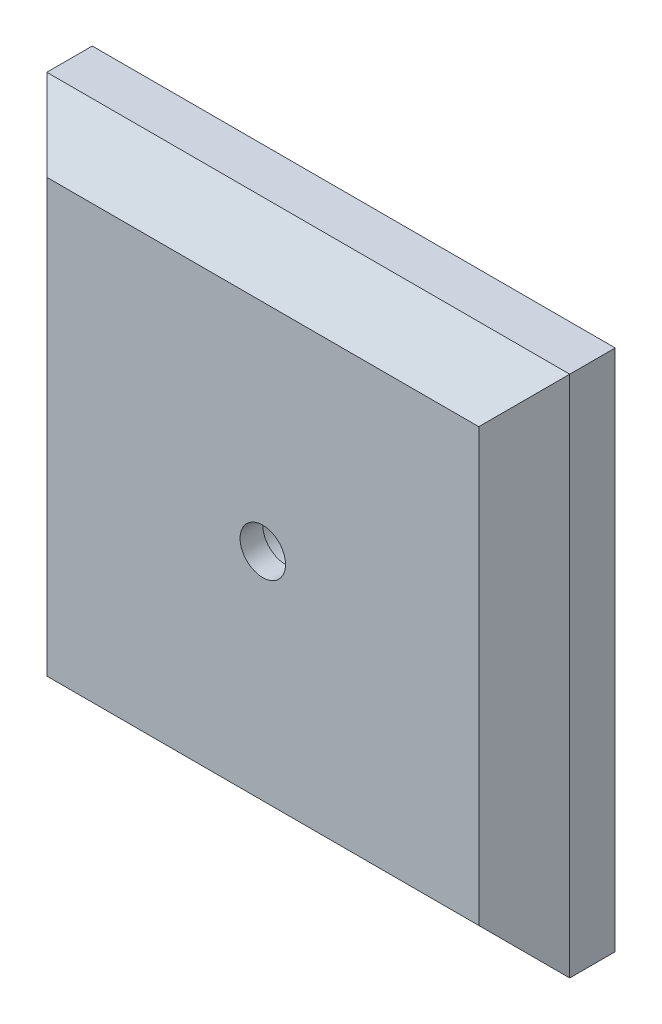
ISO-10303-21;
HEADER;
FILE_DESCRIPTION(('STEP AP214'),'2;1');
FILE_NAME('part.step','',(''),(''),'','','');
FILE_SCHEMA(('AUTOMOTIVE_DESIGN { 1 0 10303 214 1 1 1 1 }'));
ENDSEC;
DATA;
#1=APPLICATION_CONTEXT('core data for automotive mechanical design processes');
#2=APPLICATION_PROTOCOL_DEFINITION('international standard','automotive_design',2000,#1);
#3=PRODUCT_CONTEXT('',#1,'mechanical');
#4=PRODUCT('Part','Part','',(#3));
#5=PRODUCT_RELATED_PRODUCT_CATEGORY('part','',(#4));
#6=PRODUCT_DEFINITION_FORMATION('','',#4);
#7=PRODUCT_DEFINITION_CONTEXT('part definition',#1,'design');
#8=PRODUCT_DEFINITION('design','',#6,#7);
#9=PRODUCT_DEFINITION_SHAPE('','',#8);
#10=(LENGTH_UNIT() NAMED_UNIT(*) SI_UNIT(.MILLI.,.METRE.));
#11=(NAMED_UNIT(*) PLANE_ANGLE_UNIT() SI_UNIT($,.RADIAN.));
#12=(NAMED_UNIT(*) SI_UNIT($,.STERADIAN.) SOLID_ANGLE_UNIT());
#13=UNCERTAINTY_MEASURE_WITH_UNIT(LENGTH_MEASURE(1.E-05),#10,'distance_accuracy_value','');
#14=(GEOMETRIC_REPRESENTATION_CONTEXT(3) GLOBAL_UNCERTAINTY_ASSIGNED_CONTEXT((#13)) GLOBAL_UNIT_ASSIGNED_CONTEXT((#10,
#11,#12)) REPRESENTATION_CONTEXT('',''));
#15=CARTESIAN_POINT('',(0.,0.,0.));
#16=DIRECTION('',(0.,0.,1.));
#17=DIRECTION('',(1.,0.,0.));
#18=AXIS2_PLACEMENT_3D('',#15,#16,#17);
#19=CARTESIAN_POINT('',(-36.5125,-36.5125,-12.7));
#20=DIRECTION('',(-1.,0.,0.));
#21=DIRECTION('',(0.,0.,1.));
#22=AXIS2_PLACEMENT_3D('',#19,#20,#21);
#23=PLANE('',#22);
#24=DIRECTION('',(0.,0.,1.));
#25=VECTOR('',#24,1.);
#26=CARTESIAN_POINT('',(-36.5125,-36.5125,-12.7));
#27=LINE('',#26,#25);
#28=CARTESIAN_POINT('',(-36.5125,-36.5125,-12.7));
#29=VERTEX_POINT('',#28);
#30=CARTESIAN_POINT('',(-36.5125,-36.5125,-6.34999999999999));
#31=VERTEX_POINT('',#30);
#32=EDGE_CURVE('E100',#29,#31,#27,.T.);
#33=ORIENTED_EDGE('',*,*,#32,.T.);
#34=DIRECTION('',(0.,1.,0.));
#35=VECTOR('',#34,1.);
#36=CARTESIAN_POINT('',(-36.5125,-36.5125,-6.34999999999999));
#37=LINE('',#36,#35);
#38=CARTESIAN_POINT('',(-36.5125,36.5125,-6.34999999999999));
#39=VERTEX_POINT('',#38);
#40=EDGE_CURVE('E158',#31,#39,#37,.T.);
#41=ORIENTED_EDGE('',*,*,#40,.T.);
#42=DIRECTION('',(0.,0.,1.));
#43=VECTOR('',#42,1.);
#44=CARTESIAN_POINT('',(-36.5125,36.5125,-12.7));
#45=LINE('',#44,#43);
#46=CARTESIAN_POINT('',(-36.5125,36.5125,-12.7));
#47=VERTEX_POINT('',#46);
#48=EDGE_CURVE('E124',#47,#39,#45,.T.);
#49=ORIENTED_EDGE('',*,*,#48,.F.);
#50=DIRECTION('',(0.,-1.,0.));
#51=VECTOR('',#50,1.);
#52=CARTESIAN_POINT('',(-36.5125,-36.5125,-12.7));
#53=LINE('',#52,#51);
#54=EDGE_CURVE('E118',#47,#29,#53,.T.);
#55=ORIENTED_EDGE('',*,*,#54,.T.);
#56=EDGE_LOOP('',(#33,#41,#49,#55));
#57=FACE_BOUND('',#56,.T.);
#58=ADVANCED_FACE('F44',(#57),#23,.T.);
#59=CARTESIAN_POINT('',(36.5125,36.5125,-12.7));
#60=DIRECTION('',(0.,1.,0.));
#61=DIRECTION('',(-1.,0.,0.));
#62=AXIS2_PLACEMENT_3D('',#59,#60,#61);
#63=PLANE('',#62);
#64=ORIENTED_EDGE('',*,*,#48,.T.);
#65=DIRECTION('',(1.,0.,0.));
#66=VECTOR('',#65,1.);
#67=CARTESIAN_POINT('',(36.5125,36.5125,-6.34999999999999));
#68=LINE('',#67,#66);
#69=CARTESIAN_POINT('',(36.5125,36.5125,-6.34999999999999));
#70=VERTEX_POINT('',#69);
#71=EDGE_CURVE('E70',#39,#70,#68,.T.);
#72=ORIENTED_EDGE('',*,*,#71,.T.);
#73=DIRECTION('',(0.,0.,1.));
#74=VECTOR('',#73,1.);
#75=CARTESIAN_POINT('',(36.5125,36.5125,-12.7));
#76=LINE('',#75,#74);
#77=CARTESIAN_POINT('',(36.5125,36.5125,-12.7));
#78=VERTEX_POINT('',#77);
#79=EDGE_CURVE('E141',#78,#70,#76,.T.);
#80=ORIENTED_EDGE('',*,*,#79,.F.);
#81=DIRECTION('',(-1.,0.,0.));
#82=VECTOR('',#81,1.);
#83=CARTESIAN_POINT('',(36.5125,36.5125,-12.7));
#84=LINE('',#83,#82);
#85=EDGE_CURVE('E111',#78,#47,#84,.T.);
#86=ORIENTED_EDGE('',*,*,#85,.T.);
#87=EDGE_LOOP('',(#64,#72,#80,#86));
#88=FACE_BOUND('',#87,.T.);
#89=ADVANCED_FACE('F216',(#88),#63,.T.);
#90=CARTESIAN_POINT('',(36.5125,-36.5125,-12.7));
#91=DIRECTION('',(1.,0.,0.));
#92=DIRECTION('',(0.,0.,-1.));
#93=AXIS2_PLACEMENT_3D('',#90,#91,#92);
#94=PLANE('',#93);
#95=ORIENTED_EDGE('',*,*,#79,.T.);
#96=DIRECTION('',(0.,-1.,0.));
#97=VECTOR('',#96,1.);
#98=CARTESIAN_POINT('',(36.5125,-36.5125,-6.34999999999999));
#99=LINE('',#98,#97);
#100=CARTESIAN_POINT('',(36.5125,-36.5125,-6.34999999999999));
#101=VERTEX_POINT('',#100);
#102=EDGE_CURVE('E55',#70,#101,#99,.T.);
#103=ORIENTED_EDGE('',*,*,#102,.T.);
#104=DIRECTION('',(0.,0.,1.));
#105=VECTOR('',#104,1.);
#106=CARTESIAN_POINT('',(36.5125,-36.5125,-12.7));
#107=LINE('',#106,#105);
#108=CARTESIAN_POINT('',(36.5125,-36.5125,-12.7));
#109=VERTEX_POINT('',#108);
#110=EDGE_CURVE('E110',#109,#101,#107,.T.);
#111=ORIENTED_EDGE('',*,*,#110,.F.);
#112=DIRECTION('',(0.,1.,0.));
#113=VECTOR('',#112,1.);
#114=CARTESIAN_POINT('',(36.5125,-36.5125,-12.7));
#115=LINE('',#114,#113);
#116=EDGE_CURVE('E121',#109,#78,#115,.T.);
#117=ORIENTED_EDGE('',*,*,#116,.T.);
#118=EDGE_LOOP('',(#95,#103,#111,#117));
#119=FACE_BOUND('',#118,.T.);
#120=ADVANCED_FACE('F221',(#119),#94,.T.);
#121=CARTESIAN_POINT('',(36.5125,-36.5125,-12.7));
#122=DIRECTION('',(0.,-1.,0.));
#123=DIRECTION('',(1.,0.,0.));
#124=AXIS2_PLACEMENT_3D('',#121,#122,#123);
#125=PLANE('',#124);
#126=ORIENTED_EDGE('',*,*,#110,.T.);
#127=DIRECTION('',(-1.,0.,0.));
#128=VECTOR('',#127,1.);
#129=CARTESIAN_POINT('',(36.5125,-36.5125,-6.34999999999999));
#130=LINE('',#129,#128);
#131=EDGE_CURVE('E11',#101,#31,#130,.T.);
#132=ORIENTED_EDGE('',*,*,#131,.T.);
#133=ORIENTED_EDGE('',*,*,#32,.F.);
#134=DIRECTION('',(1.,0.,0.));
#135=VECTOR('',#134,1.);
#136=CARTESIAN_POINT('',(36.5125,-36.5125,-12.7));
#137=LINE('',#136,#135);
#138=EDGE_CURVE('E103',#29,#109,#137,.T.);
#139=ORIENTED_EDGE('',*,*,#138,.T.);
#140=EDGE_LOOP('',(#126,#132,#133,#139));
#141=FACE_BOUND('',#140,.T.);
#142=ADVANCED_FACE('F102',(#141),#125,.T.);
#143=CARTESIAN_POINT('',(0.,0.,-12.7));
#144=DIRECTION('',(0.,0.,1.));
#145=DIRECTION('',(1.,0.,0.));
#146=AXIS2_PLACEMENT_3D('',#143,#144,#145);
#147=PLANE('',#146);
#148=CARTESIAN_POINT('',(0.,0.,-12.7));
#149=DIRECTION('',(0.,0.,1.));
#150=DIRECTION('',(1.,0.,0.));
#151=AXIS2_PLACEMENT_3D('',#148,#149,#150);
#152=CIRCLE('',#151,4.7625);
#153=CARTESIAN_POINT('',(4.7625,0.,-12.7));
#154=VERTEX_POINT('',#153);
#155=EDGE_CURVE('E184',#154,#154,#152,.T.);
#156=ORIENTED_EDGE('',*,*,#155,.T.);
#157=EDGE_LOOP('',(#156));
#158=FACE_BOUND('',#157,.T.);
#159=ORIENTED_EDGE('',*,*,#54,.F.);
#160=ORIENTED_EDGE('',*,*,#85,.F.);
#161=ORIENTED_EDGE('',*,*,#116,.F.);
#162=ORIENTED_EDGE('',*,*,#138,.F.);
#163=EDGE_LOOP('',(#159,#160,#161,#162));
#164=FACE_BOUND('',#163,.T.);
#165=ADVANCED_FACE('F116',(#158,#164),#147,.F.);
#166=CARTESIAN_POINT('',(0.,0.,0.));
#167=DIRECTION('',(0.,0.,1.));
#168=DIRECTION('',(1.,0.,0.));
#169=AXIS2_PLACEMENT_3D('',#166,#167,#168);
#170=PLANE('',#169);
#171=DIRECTION('',(-1.,0.,0.));
#172=VECTOR('',#171,1.);
#173=CARTESIAN_POINT('',(0.,30.1625,0.));
#174=LINE('',#173,#172);
#175=CARTESIAN_POINT('',(30.1625,30.1625,0.));
#176=VERTEX_POINT('',#175);
#177=CARTESIAN_POINT('',(-30.1625,30.1625,0.));
#178=VERTEX_POINT('',#177);
#179=EDGE_CURVE('E151',#176,#178,#174,.T.);
#180=ORIENTED_EDGE('',*,*,#179,.T.);
#181=DIRECTION('',(0.,-1.,0.));
#182=VECTOR('',#181,1.);
#183=CARTESIAN_POINT('',(-30.1625,0.,0.));
#184=LINE('',#183,#182);
#185=CARTESIAN_POINT('',(-30.1625,-30.1625,0.));
#186=VERTEX_POINT('',#185);
#187=EDGE_CURVE('E154',#178,#186,#184,.T.);
#188=ORIENTED_EDGE('',*,*,#187,.T.);
#189=DIRECTION('',(1.,0.,0.));
#190=VECTOR('',#189,1.);
#191=CARTESIAN_POINT('',(0.,-30.1625,0.));
#192=LINE('',#191,#190);
#193=CARTESIAN_POINT('',(30.1625,-30.1625,0.));
#194=VERTEX_POINT('',#193);
#195=EDGE_CURVE('E140',#186,#194,#192,.T.);
#196=ORIENTED_EDGE('',*,*,#195,.T.);
#197=DIRECTION('',(0.,1.,0.));
#198=VECTOR('',#197,1.);
#199=CARTESIAN_POINT('',(30.1625,0.,0.));
#200=LINE('',#199,#198);
#201=EDGE_CURVE('E148',#194,#176,#200,.T.);
#202=ORIENTED_EDGE('',*,*,#201,.T.);
#203=EDGE_LOOP('',(#180,#188,#196,#202));
#204=FACE_BOUND('',#203,.T.);
#205=CARTESIAN_POINT('',(0.,0.,0.));
#206=DIRECTION('',(0.,0.,1.));
#207=DIRECTION('',(1.,0.,0.));
#208=AXIS2_PLACEMENT_3D('',#205,#206,#207);
#209=CIRCLE('',#208,3.175);
#210=CARTESIAN_POINT('',(3.175,0.,0.));
#211=VERTEX_POINT('',#210);
#212=EDGE_CURVE('E126',#211,#211,#209,.T.);
#213=ORIENTED_EDGE('',*,*,#212,.F.);
#214=EDGE_LOOP('',(#213));
#215=FACE_BOUND('',#214,.T.);
#216=ADVANCED_FACE('F202',(#204,#215),#170,.T.);
#217=CARTESIAN_POINT('',(0.,0.,-3.175));
#218=DIRECTION('',(0.,0.,1.));
#219=DIRECTION('',(1.,0.,0.));
#220=AXIS2_PLACEMENT_3D('',#217,#218,#219);
#221=CYLINDRICAL_SURFACE('',#220,3.175);
#222=CARTESIAN_POINT('',(0.,0.,-3.175));
#223=DIRECTION('',(0.,0.,1.));
#224=DIRECTION('',(1.,0.,0.));
#225=AXIS2_PLACEMENT_3D('',#222,#223,#224);
#226=CIRCLE('',#225,3.175);
#227=CARTESIAN_POINT('',(3.175,0.,-3.175));
#228=VERTEX_POINT('',#227);
#229=EDGE_CURVE('E130',#228,#228,#226,.T.);
#230=ORIENTED_EDGE('',*,*,#229,.F.);
#231=EDGE_LOOP('',(#230));
#232=FACE_BOUND('',#231,.T.);
#233=ORIENTED_EDGE('',*,*,#212,.T.);
#234=EDGE_LOOP('',(#233));
#235=FACE_BOUND('',#234,.T.);
#236=ADVANCED_FACE('F198',(#232,#235),#221,.F.);
#237=CARTESIAN_POINT('',(0.,0.,-12.7));
#238=DIRECTION('',(0.,0.,1.));
#239=DIRECTION('',(1.,0.,0.));
#240=AXIS2_PLACEMENT_3D('',#237,#238,#239);
#241=CYLINDRICAL_SURFACE('',#240,4.7625);
#242=ORIENTED_EDGE('',*,*,#155,.F.);
#243=EDGE_LOOP('',(#242));
#244=FACE_BOUND('',#243,.T.);
#245=CARTESIAN_POINT('',(0.,0.,-3.175));
#246=DIRECTION('',(0.,0.,1.));
#247=DIRECTION('',(1.,0.,0.));
#248=AXIS2_PLACEMENT_3D('',#245,#246,#247);
#249=CIRCLE('',#248,4.7625);
#250=CARTESIAN_POINT('',(4.7625,0.,-3.175));
#251=VERTEX_POINT('',#250);
#252=EDGE_CURVE('E178',#251,#251,#249,.T.);
#253=ORIENTED_EDGE('',*,*,#252,.T.);
#254=EDGE_LOOP('',(#253));
#255=FACE_BOUND('',#254,.T.);
#256=ADVANCED_FACE('F201',(#244,#255),#241,.F.);
#257=CARTESIAN_POINT('',(0.,0.,-3.175));
#258=DIRECTION('',(0.,0.,1.));
#259=DIRECTION('',(1.,0.,0.));
#260=AXIS2_PLACEMENT_3D('',#257,#258,#259);
#261=PLANE('',#260);
#262=ORIENTED_EDGE('',*,*,#229,.T.);
#263=EDGE_LOOP('',(#262));
#264=FACE_BOUND('',#263,.T.);
#265=ORIENTED_EDGE('',*,*,#252,.F.);
#266=EDGE_LOOP('',(#265));
#267=FACE_BOUND('',#266,.T.);
#268=ADVANCED_FACE('F195',(#264,#267),#261,.F.);
#269=CARTESIAN_POINT('',(30.1625,0.,0.));
#270=DIRECTION('',(-0.707106781186547,0.,-0.707106781186548));
#271=DIRECTION('',(0.,1.,0.));
#272=AXIS2_PLACEMENT_3D('',#269,#270,#271);
#273=PLANE('',#272);
#274=DIRECTION('',(-0.577350269189626,0.577350269189626,0.577350269189625));
#275=VECTOR('',#274,1.);
#276=CARTESIAN_POINT('',(20.1083333333333,-20.1083333333333,10.0541666666666));
#277=LINE('',#276,#275);
#278=EDGE_CURVE('E170',#101,#194,#277,.T.);
#279=ORIENTED_EDGE('',*,*,#278,.F.);
#280=ORIENTED_EDGE('',*,*,#102,.F.);
#281=DIRECTION('',(-0.577350269189626,-0.577350269189626,0.577350269189625));
#282=VECTOR('',#281,1.);
#283=CARTESIAN_POINT('',(20.1083333333333,20.1083333333333,10.0541666666667));
#284=LINE('',#283,#282);
#285=EDGE_CURVE('E49',#176,#70,#284,.F.);
#286=ORIENTED_EDGE('',*,*,#285,.F.);
#287=ORIENTED_EDGE('',*,*,#201,.F.);
#288=EDGE_LOOP('',(#279,#280,#286,#287));
#289=FACE_BOUND('',#288,.T.);
#290=ADVANCED_FACE('F47',(#289),#273,.F.);
#291=CARTESIAN_POINT('',(0.,30.1625,0.));
#292=DIRECTION('',(0.,-0.707106781186547,-0.707106781186548));
#293=DIRECTION('',(-1.,0.,0.));
#294=AXIS2_PLACEMENT_3D('',#291,#292,#293);
#295=PLANE('',#294);
#296=ORIENTED_EDGE('',*,*,#285,.T.);
#297=ORIENTED_EDGE('',*,*,#71,.F.);
#298=DIRECTION('',(0.577350269189626,-0.577350269189626,0.577350269189625));
#299=VECTOR('',#298,1.);
#300=CARTESIAN_POINT('',(-20.1083333333333,20.1083333333333,10.0541666666667));
#301=LINE('',#300,#299);
#302=EDGE_CURVE('E168',#178,#39,#301,.F.);
#303=ORIENTED_EDGE('',*,*,#302,.F.);
#304=ORIENTED_EDGE('',*,*,#179,.F.);
#305=EDGE_LOOP('',(#296,#297,#303,#304));
#306=FACE_BOUND('',#305,.T.);
#307=ADVANCED_FACE('F238',(#306),#295,.F.);
#308=CARTESIAN_POINT('',(0.,-30.1625,0.));
#309=DIRECTION('',(0.,0.707106781186547,-0.707106781186548));
#310=DIRECTION('',(1.,0.,0.));
#311=AXIS2_PLACEMENT_3D('',#308,#309,#310);
#312=PLANE('',#311);
#313=ORIENTED_EDGE('',*,*,#278,.T.);
#314=ORIENTED_EDGE('',*,*,#195,.F.);
#315=DIRECTION('',(-0.577350269189626,-0.577350269189626,-0.577350269189625));
#316=VECTOR('',#315,1.);
#317=CARTESIAN_POINT('',(-20.1083333333333,-20.1083333333333,10.0541666666667));
#318=LINE('',#317,#316);
#319=EDGE_CURVE('E165',#31,#186,#318,.F.);
#320=ORIENTED_EDGE('',*,*,#319,.F.);
#321=ORIENTED_EDGE('',*,*,#131,.F.);
#322=EDGE_LOOP('',(#313,#314,#320,#321));
#323=FACE_BOUND('',#322,.T.);
#324=ADVANCED_FACE('F232',(#323),#312,.F.);
#325=CARTESIAN_POINT('',(-30.1625,0.,0.));
#326=DIRECTION('',(0.707106781186547,0.,-0.707106781186548));
#327=DIRECTION('',(0.,-1.,0.));
#328=AXIS2_PLACEMENT_3D('',#325,#326,#327);
#329=PLANE('',#328);
#330=ORIENTED_EDGE('',*,*,#302,.T.);
#331=ORIENTED_EDGE('',*,*,#40,.F.);
#332=ORIENTED_EDGE('',*,*,#319,.T.);
#333=ORIENTED_EDGE('',*,*,#187,.F.);
#334=EDGE_LOOP('',(#330,#331,#332,#333));
#335=FACE_BOUND('',#334,.T.);
#336=ADVANCED_FACE('F226',(#335),#329,.F.);
#337=CLOSED_SHELL('',(#58,#89,#120,#142,#165,#216,#236,#256,#268,#290,#307,#324,#336));
#338=MANIFOLD_SOLID_BREP('B2',#337);
#339=ADVANCED_BREP_SHAPE_REPRESENTATION('',(#18,#338),#14);
#340=SHAPE_DEFINITION_REPRESENTATION(#9,#339);
ENDSEC;
END-ISO-10303-21;
